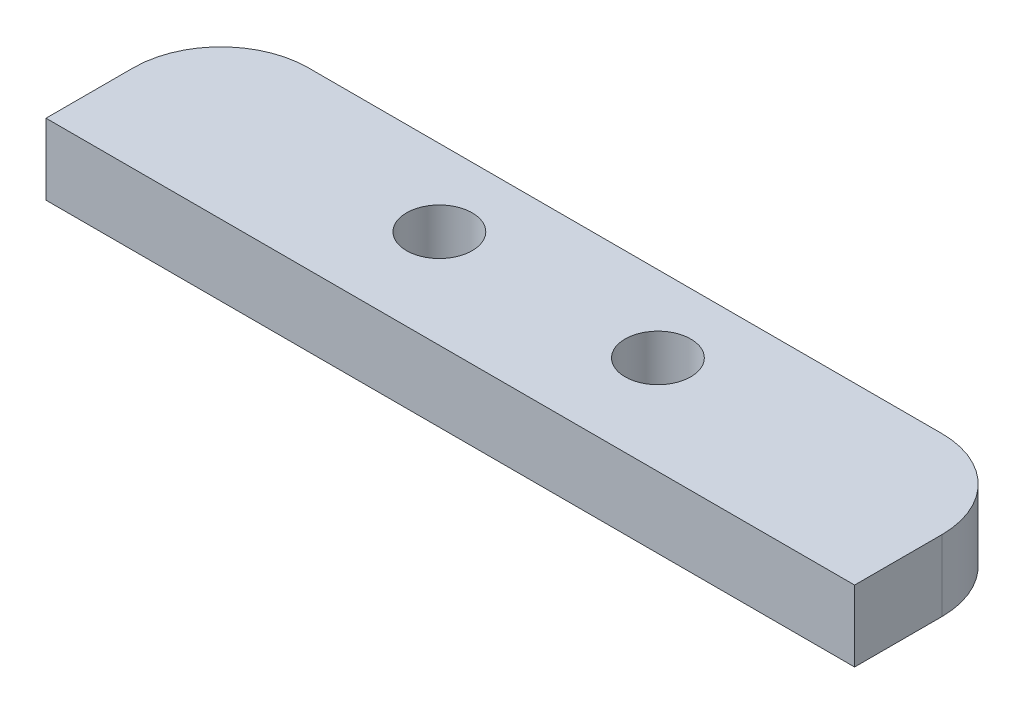
ISO-10303-21;
HEADER;
FILE_DESCRIPTION(('STEP AP214'),'2;1');
FILE_NAME('part.step','',(''),(''),'','','');
FILE_SCHEMA(('AUTOMOTIVE_DESIGN { 1 0 10303 214 1 1 1 1 }'));
ENDSEC;
DATA;
#1=APPLICATION_CONTEXT('core data for automotive mechanical design processes');
#2=APPLICATION_PROTOCOL_DEFINITION('international standard','automotive_design',2000,#1);
#3=PRODUCT_CONTEXT('',#1,'mechanical');
#4=PRODUCT('Part','Part','',(#3));
#5=PRODUCT_RELATED_PRODUCT_CATEGORY('part','',(#4));
#6=PRODUCT_DEFINITION_FORMATION('','',#4);
#7=PRODUCT_DEFINITION_CONTEXT('part definition',#1,'design');
#8=PRODUCT_DEFINITION('design','',#6,#7);
#9=PRODUCT_DEFINITION_SHAPE('','',#8);
#10=(LENGTH_UNIT() NAMED_UNIT(*) SI_UNIT(.MILLI.,.METRE.));
#11=(NAMED_UNIT(*) PLANE_ANGLE_UNIT() SI_UNIT($,.RADIAN.));
#12=(NAMED_UNIT(*) SI_UNIT($,.STERADIAN.) SOLID_ANGLE_UNIT());
#13=UNCERTAINTY_MEASURE_WITH_UNIT(LENGTH_MEASURE(1.E-05),#10,'distance_accuracy_value','');
#14=(GEOMETRIC_REPRESENTATION_CONTEXT(3) GLOBAL_UNCERTAINTY_ASSIGNED_CONTEXT((#13)) GLOBAL_UNIT_ASSIGNED_CONTEXT((#10,
#11,#12)) REPRESENTATION_CONTEXT('',''));
#15=CARTESIAN_POINT('',(0.,0.,0.));
#16=DIRECTION('',(0.,0.,1.));
#17=DIRECTION('',(1.,0.,0.));
#18=AXIS2_PLACEMENT_3D('',#15,#16,#17);
#19=CARTESIAN_POINT('',(-14.5,3.25,0.));
#20=DIRECTION('',(0.,1.,0.));
#21=DIRECTION('',(0.,0.,1.));
#22=AXIS2_PLACEMENT_3D('',#19,#20,#21);
#23=PLANE('',#22);
#24=CARTESIAN_POINT('',(-5.,3.25,-0.5));
#25=DIRECTION('',(0.,1.,0.));
#26=DIRECTION('',(0.,0.,1.));
#27=AXIS2_PLACEMENT_3D('',#24,#25,#26);
#28=CIRCLE('',#27,1.5025);
#29=CARTESIAN_POINT('',(-5.,3.25,1.0025));
#30=VERTEX_POINT('',#29);
#31=EDGE_CURVE('E123',#30,#30,#28,.T.);
#32=ORIENTED_EDGE('',*,*,#31,.F.);
#33=EDGE_LOOP('',(#32));
#34=FACE_BOUND('',#33,.T.);
#35=DIRECTION('',(0.,0.,-1.));
#36=VECTOR('',#35,1.);
#37=CARTESIAN_POINT('',(18.5,3.25,0.));
#38=LINE('',#37,#36);
#39=CARTESIAN_POINT('',(18.5,3.25,4.));
#40=VERTEX_POINT('',#39);
#41=CARTESIAN_POINT('',(18.5,3.25,0.));
#42=VERTEX_POINT('',#41);
#43=EDGE_CURVE('E130',#40,#42,#38,.T.);
#44=ORIENTED_EDGE('',*,*,#43,.T.);
#45=CARTESIAN_POINT('',(14.5,3.25,0.));
#46=DIRECTION('',(0.,1.,0.));
#47=DIRECTION('',(0.,0.,-1.));
#48=AXIS2_PLACEMENT_3D('',#45,#46,#47);
#49=CIRCLE('',#48,4.);
#50=CARTESIAN_POINT('',(14.5,3.25,-4.));
#51=VERTEX_POINT('',#50);
#52=EDGE_CURVE('E88',#42,#51,#49,.T.);
#53=ORIENTED_EDGE('',*,*,#52,.T.);
#54=DIRECTION('',(-1.,0.,0.));
#55=VECTOR('',#54,1.);
#56=CARTESIAN_POINT('',(-14.5,3.25,-4.));
#57=LINE('',#56,#55);
#58=CARTESIAN_POINT('',(-14.5,3.25,-4.));
#59=VERTEX_POINT('',#58);
#60=EDGE_CURVE('E101',#51,#59,#57,.T.);
#61=ORIENTED_EDGE('',*,*,#60,.T.);
#62=CARTESIAN_POINT('',(-14.5,3.25,0.));
#63=DIRECTION('',(0.,1.,0.));
#64=DIRECTION('',(0.,0.,1.));
#65=AXIS2_PLACEMENT_3D('',#62,#63,#64);
#66=CIRCLE('',#65,4.);
#67=CARTESIAN_POINT('',(-18.5,3.25,0.));
#68=VERTEX_POINT('',#67);
#69=EDGE_CURVE('E95',#59,#68,#66,.T.);
#70=ORIENTED_EDGE('',*,*,#69,.T.);
#71=DIRECTION('',(0.,0.,1.));
#72=VECTOR('',#71,1.);
#73=CARTESIAN_POINT('',(-18.5,3.25,0.));
#74=LINE('',#73,#72);
#75=CARTESIAN_POINT('',(-18.5,3.25,4.));
#76=VERTEX_POINT('',#75);
#77=EDGE_CURVE('E99',#68,#76,#74,.T.);
#78=ORIENTED_EDGE('',*,*,#77,.T.);
#79=DIRECTION('',(1.,0.,0.));
#80=VECTOR('',#79,1.);
#81=CARTESIAN_POINT('',(-18.5,3.25,4.));
#82=LINE('',#81,#80);
#83=EDGE_CURVE('E51',#76,#40,#82,.T.);
#84=ORIENTED_EDGE('',*,*,#83,.T.);
#85=EDGE_LOOP('',(#44,#53,#61,#70,#78,#84));
#86=FACE_BOUND('',#85,.T.);
#87=CARTESIAN_POINT('',(5.,3.25,-0.5));
#88=DIRECTION('',(0.,1.,0.));
#89=DIRECTION('',(0.,0.,1.));
#90=AXIS2_PLACEMENT_3D('',#87,#88,#89);
#91=CIRCLE('',#90,1.5025);
#92=CARTESIAN_POINT('',(5.,3.25,1.0025));
#93=VERTEX_POINT('',#92);
#94=EDGE_CURVE('E172',#93,#93,#91,.T.);
#95=ORIENTED_EDGE('',*,*,#94,.F.);
#96=EDGE_LOOP('',(#95));
#97=FACE_BOUND('',#96,.T.);
#98=ADVANCED_FACE('F34',(#34,#86,#97),#23,.T.);
#99=CARTESIAN_POINT('',(-14.5,0.,0.));
#100=DIRECTION('',(0.,1.,0.));
#101=DIRECTION('',(0.,0.,1.));
#102=AXIS2_PLACEMENT_3D('',#99,#100,#101);
#103=PLANE('',#102);
#104=DIRECTION('',(0.,0.,-1.));
#105=VECTOR('',#104,1.);
#106=CARTESIAN_POINT('',(18.5,0.,0.));
#107=LINE('',#106,#105);
#108=CARTESIAN_POINT('',(18.5,0.,4.));
#109=VERTEX_POINT('',#108);
#110=CARTESIAN_POINT('',(18.5,0.,0.));
#111=VERTEX_POINT('',#110);
#112=EDGE_CURVE('E119',#109,#111,#107,.T.);
#113=ORIENTED_EDGE('',*,*,#112,.F.);
#114=DIRECTION('',(1.,0.,0.));
#115=VECTOR('',#114,1.);
#116=CARTESIAN_POINT('',(-18.5,0.,4.));
#117=LINE('',#116,#115);
#118=CARTESIAN_POINT('',(-18.5,0.,4.));
#119=VERTEX_POINT('',#118);
#120=EDGE_CURVE('E80',#119,#109,#117,.T.);
#121=ORIENTED_EDGE('',*,*,#120,.F.);
#122=DIRECTION('',(0.,0.,1.));
#123=VECTOR('',#122,1.);
#124=CARTESIAN_POINT('',(-18.5,0.,0.));
#125=LINE('',#124,#123);
#126=CARTESIAN_POINT('',(-18.5,0.,0.));
#127=VERTEX_POINT('',#126);
#128=EDGE_CURVE('E74',#127,#119,#125,.T.);
#129=ORIENTED_EDGE('',*,*,#128,.F.);
#130=CARTESIAN_POINT('',(-14.5,0.,0.));
#131=DIRECTION('',(0.,1.,0.));
#132=DIRECTION('',(0.,0.,1.));
#133=AXIS2_PLACEMENT_3D('',#130,#131,#132);
#134=CIRCLE('',#133,4.);
#135=CARTESIAN_POINT('',(-14.5,0.,-4.));
#136=VERTEX_POINT('',#135);
#137=EDGE_CURVE('E109',#136,#127,#134,.T.);
#138=ORIENTED_EDGE('',*,*,#137,.F.);
#139=DIRECTION('',(-1.,0.,0.));
#140=VECTOR('',#139,1.);
#141=CARTESIAN_POINT('',(-14.5,0.,-4.));
#142=LINE('',#141,#140);
#143=CARTESIAN_POINT('',(14.5,0.,-4.));
#144=VERTEX_POINT('',#143);
#145=EDGE_CURVE('E125',#144,#136,#142,.T.);
#146=ORIENTED_EDGE('',*,*,#145,.F.);
#147=CARTESIAN_POINT('',(14.5,0.,0.));
#148=DIRECTION('',(0.,1.,0.));
#149=DIRECTION('',(0.,0.,-1.));
#150=AXIS2_PLACEMENT_3D('',#147,#148,#149);
#151=CIRCLE('',#150,4.);
#152=EDGE_CURVE('E122',#111,#144,#151,.T.);
#153=ORIENTED_EDGE('',*,*,#152,.F.);
#154=EDGE_LOOP('',(#113,#121,#129,#138,#146,#153));
#155=FACE_BOUND('',#154,.T.);
#156=CARTESIAN_POINT('',(-5.,0.,-0.5));
#157=DIRECTION('',(0.,1.,0.));
#158=DIRECTION('',(0.,0.,1.));
#159=AXIS2_PLACEMENT_3D('',#156,#157,#158);
#160=CIRCLE('',#159,1.5025);
#161=CARTESIAN_POINT('',(-5.,0.,1.0025));
#162=VERTEX_POINT('',#161);
#163=EDGE_CURVE('E178',#162,#162,#160,.T.);
#164=ORIENTED_EDGE('',*,*,#163,.T.);
#165=EDGE_LOOP('',(#164));
#166=FACE_BOUND('',#165,.T.);
#167=CARTESIAN_POINT('',(5.,0.,-0.5));
#168=DIRECTION('',(0.,1.,0.));
#169=DIRECTION('',(0.,0.,1.));
#170=AXIS2_PLACEMENT_3D('',#167,#168,#169);
#171=CIRCLE('',#170,1.5025);
#172=CARTESIAN_POINT('',(5.,0.,1.0025));
#173=VERTEX_POINT('',#172);
#174=EDGE_CURVE('E175',#173,#173,#171,.T.);
#175=ORIENTED_EDGE('',*,*,#174,.T.);
#176=EDGE_LOOP('',(#175));
#177=FACE_BOUND('',#176,.T.);
#178=ADVANCED_FACE('F139',(#155,#166,#177),#103,.F.);
#179=CARTESIAN_POINT('',(18.5,3.25,0.));
#180=DIRECTION('',(-1.,0.,0.));
#181=DIRECTION('',(0.,0.,1.));
#182=AXIS2_PLACEMENT_3D('',#179,#180,#181);
#183=PLANE('',#182);
#184=ORIENTED_EDGE('',*,*,#112,.T.);
#185=DIRECTION('',(0.,-1.,0.));
#186=VECTOR('',#185,1.);
#187=CARTESIAN_POINT('',(18.5,3.25,0.));
#188=LINE('',#187,#186);
#189=EDGE_CURVE('E11',#42,#111,#188,.T.);
#190=ORIENTED_EDGE('',*,*,#189,.F.);
#191=ORIENTED_EDGE('',*,*,#43,.F.);
#192=DIRECTION('',(0.,-1.,0.));
#193=VECTOR('',#192,1.);
#194=CARTESIAN_POINT('',(18.5,3.25,4.));
#195=LINE('',#194,#193);
#196=EDGE_CURVE('E115',#40,#109,#195,.T.);
#197=ORIENTED_EDGE('',*,*,#196,.T.);
#198=EDGE_LOOP('',(#184,#190,#191,#197));
#199=FACE_BOUND('',#198,.T.);
#200=ADVANCED_FACE('F36',(#199),#183,.F.);
#201=CARTESIAN_POINT('',(14.5,3.25,0.));
#202=DIRECTION('',(0.,-1.,0.));
#203=DIRECTION('',(0.,0.,-1.));
#204=AXIS2_PLACEMENT_3D('',#201,#202,#203);
#205=CYLINDRICAL_SURFACE('',#204,4.);
#206=ORIENTED_EDGE('',*,*,#152,.T.);
#207=DIRECTION('',(0.,-1.,0.));
#208=VECTOR('',#207,1.);
#209=CARTESIAN_POINT('',(14.5,3.25,-4.));
#210=LINE('',#209,#208);
#211=EDGE_CURVE('E43',#51,#144,#210,.T.);
#212=ORIENTED_EDGE('',*,*,#211,.F.);
#213=ORIENTED_EDGE('',*,*,#52,.F.);
#214=ORIENTED_EDGE('',*,*,#189,.T.);
#215=EDGE_LOOP('',(#206,#212,#213,#214));
#216=FACE_BOUND('',#215,.T.);
#217=ADVANCED_FACE('F219',(#216),#205,.T.);
#218=CARTESIAN_POINT('',(-14.5,3.25,-4.));
#219=DIRECTION('',(0.,0.,1.));
#220=DIRECTION('',(1.,0.,0.));
#221=AXIS2_PLACEMENT_3D('',#218,#219,#220);
#222=PLANE('',#221);
#223=ORIENTED_EDGE('',*,*,#145,.T.);
#224=DIRECTION('',(0.,-1.,0.));
#225=VECTOR('',#224,1.);
#226=CARTESIAN_POINT('',(-14.5,3.25,-4.));
#227=LINE('',#226,#225);
#228=EDGE_CURVE('E110',#59,#136,#227,.T.);
#229=ORIENTED_EDGE('',*,*,#228,.F.);
#230=ORIENTED_EDGE('',*,*,#60,.F.);
#231=ORIENTED_EDGE('',*,*,#211,.T.);
#232=EDGE_LOOP('',(#223,#229,#230,#231));
#233=FACE_BOUND('',#232,.T.);
#234=ADVANCED_FACE('F136',(#233),#222,.F.);
#235=CARTESIAN_POINT('',(-14.5,3.25,0.));
#236=DIRECTION('',(0.,-1.,0.));
#237=DIRECTION('',(0.,0.,-1.));
#238=AXIS2_PLACEMENT_3D('',#235,#236,#237);
#239=CYLINDRICAL_SURFACE('',#238,4.);
#240=ORIENTED_EDGE('',*,*,#137,.T.);
#241=DIRECTION('',(0.,-1.,0.));
#242=VECTOR('',#241,1.);
#243=CARTESIAN_POINT('',(-18.5,3.25,0.));
#244=LINE('',#243,#242);
#245=EDGE_CURVE('E106',#68,#127,#244,.T.);
#246=ORIENTED_EDGE('',*,*,#245,.F.);
#247=ORIENTED_EDGE('',*,*,#69,.F.);
#248=ORIENTED_EDGE('',*,*,#228,.T.);
#249=EDGE_LOOP('',(#240,#246,#247,#248));
#250=FACE_BOUND('',#249,.T.);
#251=ADVANCED_FACE('F107',(#250),#239,.T.);
#252=CARTESIAN_POINT('',(-18.5,3.25,0.));
#253=DIRECTION('',(1.,0.,0.));
#254=DIRECTION('',(0.,0.,-1.));
#255=AXIS2_PLACEMENT_3D('',#252,#253,#254);
#256=PLANE('',#255);
#257=ORIENTED_EDGE('',*,*,#128,.T.);
#258=DIRECTION('',(0.,-1.,0.));
#259=VECTOR('',#258,1.);
#260=CARTESIAN_POINT('',(-18.5,3.25,4.));
#261=LINE('',#260,#259);
#262=EDGE_CURVE('E111',#76,#119,#261,.T.);
#263=ORIENTED_EDGE('',*,*,#262,.F.);
#264=ORIENTED_EDGE('',*,*,#77,.F.);
#265=ORIENTED_EDGE('',*,*,#245,.T.);
#266=EDGE_LOOP('',(#257,#263,#264,#265));
#267=FACE_BOUND('',#266,.T.);
#268=ADVANCED_FACE('F113',(#267),#256,.F.);
#269=CARTESIAN_POINT('',(-18.5,3.25,4.));
#270=DIRECTION('',(0.,0.,-1.));
#271=DIRECTION('',(-1.,0.,0.));
#272=AXIS2_PLACEMENT_3D('',#269,#270,#271);
#273=PLANE('',#272);
#274=ORIENTED_EDGE('',*,*,#120,.T.);
#275=ORIENTED_EDGE('',*,*,#196,.F.);
#276=ORIENTED_EDGE('',*,*,#83,.F.);
#277=ORIENTED_EDGE('',*,*,#262,.T.);
#278=EDGE_LOOP('',(#274,#275,#276,#277));
#279=FACE_BOUND('',#278,.T.);
#280=ADVANCED_FACE('F144',(#279),#273,.F.);
#281=CARTESIAN_POINT('',(-5.,3.25,-0.5));
#282=DIRECTION('',(0.,-1.,0.));
#283=DIRECTION('',(0.,0.,-1.));
#284=AXIS2_PLACEMENT_3D('',#281,#282,#283);
#285=CYLINDRICAL_SURFACE('',#284,1.5025);
#286=ORIENTED_EDGE('',*,*,#31,.T.);
#287=EDGE_LOOP('',(#286));
#288=FACE_BOUND('',#287,.T.);
#289=ORIENTED_EDGE('',*,*,#163,.F.);
#290=EDGE_LOOP('',(#289));
#291=FACE_BOUND('',#290,.T.);
#292=ADVANCED_FACE('F146',(#288,#291),#285,.F.);
#293=CARTESIAN_POINT('',(5.,3.25,-0.5));
#294=DIRECTION('',(0.,-1.,0.));
#295=DIRECTION('',(0.,0.,-1.));
#296=AXIS2_PLACEMENT_3D('',#293,#294,#295);
#297=CYLINDRICAL_SURFACE('',#296,1.5025);
#298=ORIENTED_EDGE('',*,*,#94,.T.);
#299=EDGE_LOOP('',(#298));
#300=FACE_BOUND('',#299,.T.);
#301=ORIENTED_EDGE('',*,*,#174,.F.);
#302=EDGE_LOOP('',(#301));
#303=FACE_BOUND('',#302,.T.);
#304=ADVANCED_FACE('F152',(#300,#303),#297,.F.);
#305=CLOSED_SHELL('',(#98,#178,#200,#217,#234,#251,#268,#280,#292,#304));
#306=MANIFOLD_SOLID_BREP('B2',#305);
#307=ADVANCED_BREP_SHAPE_REPRESENTATION('',(#18,#306),#14);
#308=SHAPE_DEFINITION_REPRESENTATION(#9,#307);
ENDSEC;
END-ISO-10303-21;
